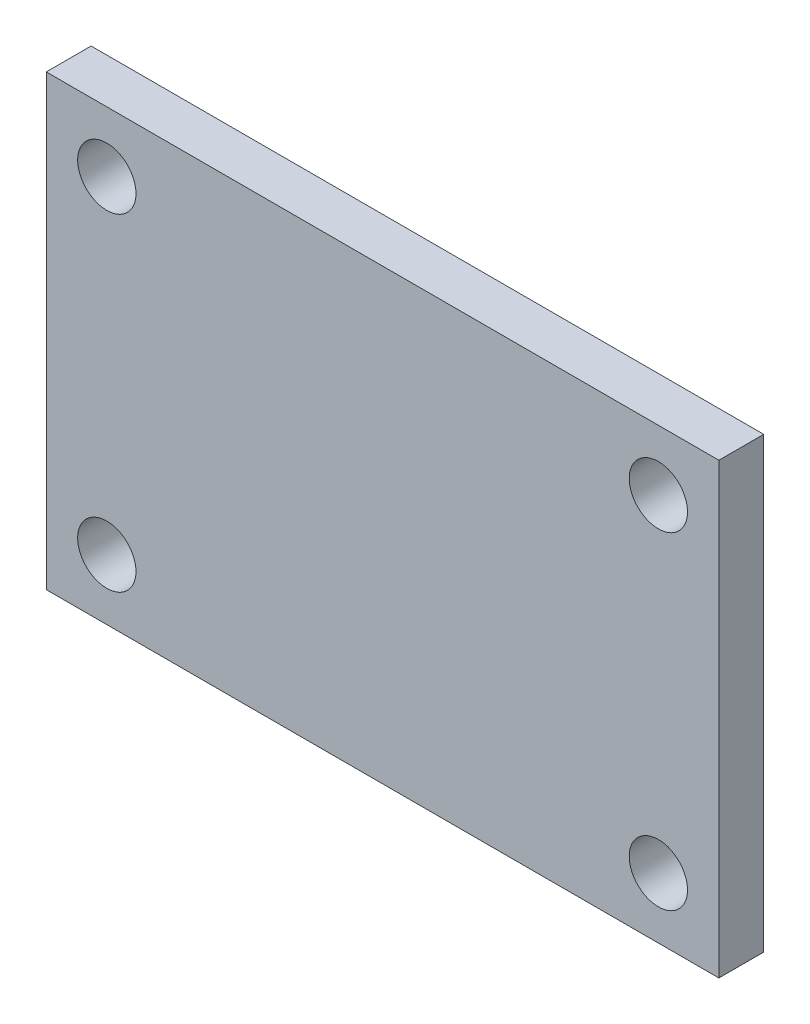
ISO-10303-21;
HEADER;
FILE_DESCRIPTION(('STEP AP214'),'2;1');
FILE_NAME('part.step','',(''),(''),'','','');
FILE_SCHEMA(('AUTOMOTIVE_DESIGN { 1 0 10303 214 1 1 1 1 }'));
ENDSEC;
DATA;
#1=APPLICATION_CONTEXT('core data for automotive mechanical design processes');
#2=APPLICATION_PROTOCOL_DEFINITION('international standard','automotive_design',2000,#1);
#3=PRODUCT_CONTEXT('',#1,'mechanical');
#4=PRODUCT('Part','Part','',(#3));
#5=PRODUCT_RELATED_PRODUCT_CATEGORY('part','',(#4));
#6=PRODUCT_DEFINITION_FORMATION('','',#4);
#7=PRODUCT_DEFINITION_CONTEXT('part definition',#1,'design');
#8=PRODUCT_DEFINITION('design','',#6,#7);
#9=PRODUCT_DEFINITION_SHAPE('','',#8);
#10=(LENGTH_UNIT() NAMED_UNIT(*) SI_UNIT(.MILLI.,.METRE.));
#11=(NAMED_UNIT(*) PLANE_ANGLE_UNIT() SI_UNIT($,.RADIAN.));
#12=(NAMED_UNIT(*) SI_UNIT($,.STERADIAN.) SOLID_ANGLE_UNIT());
#13=UNCERTAINTY_MEASURE_WITH_UNIT(LENGTH_MEASURE(1.E-05),#10,'distance_accuracy_value','');
#14=(GEOMETRIC_REPRESENTATION_CONTEXT(3) GLOBAL_UNCERTAINTY_ASSIGNED_CONTEXT((#13)) GLOBAL_UNIT_ASSIGNED_CONTEXT((#10,
#11,#12)) REPRESENTATION_CONTEXT('',''));
#15=CARTESIAN_POINT('',(0.,0.,0.));
#16=DIRECTION('',(0.,0.,1.));
#17=DIRECTION('',(1.,0.,0.));
#18=AXIS2_PLACEMENT_3D('',#15,#16,#17);
#19=CARTESIAN_POINT('',(150.,-50.,5.));
#20=DIRECTION('',(0.,1.,0.));
#21=DIRECTION('',(0.,0.,1.));
#22=AXIS2_PLACEMENT_3D('',#19,#20,#21);
#23=PLANE('',#22);
#24=DIRECTION('',(0.,0.,-1.));
#25=VECTOR('',#24,1.);
#26=CARTESIAN_POINT('',(0.,-50.,5.));
#27=LINE('',#26,#25);
#28=CARTESIAN_POINT('',(0.,-50.,5.));
#29=VERTEX_POINT('',#28);
#30=CARTESIAN_POINT('',(0.,-50.,-5.));
#31=VERTEX_POINT('',#30);
#32=EDGE_CURVE('E113',#29,#31,#27,.T.);
#33=ORIENTED_EDGE('',*,*,#32,.T.);
#34=DIRECTION('',(-1.,0.,0.));
#35=VECTOR('',#34,1.);
#36=CARTESIAN_POINT('',(150.,-50.,-5.));
#37=LINE('',#36,#35);
#38=CARTESIAN_POINT('',(150.,-50.,-5.));
#39=VERTEX_POINT('',#38);
#40=EDGE_CURVE('E12',#39,#31,#37,.T.);
#41=ORIENTED_EDGE('',*,*,#40,.F.);
#42=DIRECTION('',(0.,0.,-1.));
#43=VECTOR('',#42,1.);
#44=CARTESIAN_POINT('',(150.,-50.,5.));
#45=LINE('',#44,#43);
#46=CARTESIAN_POINT('',(150.,-50.,5.));
#47=VERTEX_POINT('',#46);
#48=EDGE_CURVE('E101',#47,#39,#45,.T.);
#49=ORIENTED_EDGE('',*,*,#48,.F.);
#50=DIRECTION('',(-1.,0.,0.));
#51=VECTOR('',#50,1.);
#52=CARTESIAN_POINT('',(150.,-50.,5.));
#53=LINE('',#52,#51);
#54=EDGE_CURVE('E109',#47,#29,#53,.T.);
#55=ORIENTED_EDGE('',*,*,#54,.T.);
#56=EDGE_LOOP('',(#33,#41,#49,#55));
#57=FACE_BOUND('',#56,.T.);
#58=ADVANCED_FACE('F50',(#57),#23,.F.);
#59=CARTESIAN_POINT('',(150.,-50.,-5.));
#60=DIRECTION('',(0.,0.,1.));
#61=DIRECTION('',(1.,0.,0.));
#62=AXIS2_PLACEMENT_3D('',#59,#60,#61);
#63=PLANE('',#62);
#64=CARTESIAN_POINT('',(13.5,36.5,-5.));
#65=DIRECTION('',(0.,0.,1.));
#66=DIRECTION('',(1.,0.,0.));
#67=AXIS2_PLACEMENT_3D('',#64,#65,#66);
#68=CIRCLE('',#67,6.5);
#69=CARTESIAN_POINT('',(20.,36.5,-5.));
#70=VERTEX_POINT('',#69);
#71=EDGE_CURVE('E144',#70,#70,#68,.T.);
#72=ORIENTED_EDGE('',*,*,#71,.T.);
#73=EDGE_LOOP('',(#72));
#74=FACE_BOUND('',#73,.T.);
#75=CARTESIAN_POINT('',(136.5,36.5,-5.));
#76=DIRECTION('',(0.,0.,1.));
#77=DIRECTION('',(1.,0.,0.));
#78=AXIS2_PLACEMENT_3D('',#75,#76,#77);
#79=CIRCLE('',#78,6.50000000000001);
#80=CARTESIAN_POINT('',(143.,36.5,-5.));
#81=VERTEX_POINT('',#80);
#82=EDGE_CURVE('E138',#81,#81,#79,.T.);
#83=ORIENTED_EDGE('',*,*,#82,.T.);
#84=EDGE_LOOP('',(#83));
#85=FACE_BOUND('',#84,.T.);
#86=CARTESIAN_POINT('',(136.5,-36.5,-5.));
#87=DIRECTION('',(0.,0.,1.));
#88=DIRECTION('',(1.,0.,0.));
#89=AXIS2_PLACEMENT_3D('',#86,#87,#88);
#90=CIRCLE('',#89,6.50000000000001);
#91=CARTESIAN_POINT('',(143.,-36.5,-5.));
#92=VERTEX_POINT('',#91);
#93=EDGE_CURVE('E132',#92,#92,#90,.T.);
#94=ORIENTED_EDGE('',*,*,#93,.T.);
#95=EDGE_LOOP('',(#94));
#96=FACE_BOUND('',#95,.T.);
#97=CARTESIAN_POINT('',(13.5,-36.5,-5.));
#98=DIRECTION('',(0.,0.,1.));
#99=DIRECTION('',(1.,0.,0.));
#100=AXIS2_PLACEMENT_3D('',#97,#98,#99);
#101=CIRCLE('',#100,6.5);
#102=CARTESIAN_POINT('',(20.,-36.5,-5.));
#103=VERTEX_POINT('',#102);
#104=EDGE_CURVE('E116',#103,#103,#101,.T.);
#105=ORIENTED_EDGE('',*,*,#104,.T.);
#106=EDGE_LOOP('',(#105));
#107=FACE_BOUND('',#106,.T.);
#108=DIRECTION('',(0.,1.,0.));
#109=VECTOR('',#108,1.);
#110=CARTESIAN_POINT('',(0.,-50.,-5.));
#111=LINE('',#110,#109);
#112=CARTESIAN_POINT('',(0.,50.,-5.));
#113=VERTEX_POINT('',#112);
#114=EDGE_CURVE('E105',#31,#113,#111,.T.);
#115=ORIENTED_EDGE('',*,*,#114,.T.);
#116=DIRECTION('',(-1.,0.,0.));
#117=VECTOR('',#116,1.);
#118=CARTESIAN_POINT('',(150.,50.,-5.));
#119=LINE('',#118,#117);
#120=CARTESIAN_POINT('',(150.,50.,-5.));
#121=VERTEX_POINT('',#120);
#122=EDGE_CURVE('E58',#121,#113,#119,.T.);
#123=ORIENTED_EDGE('',*,*,#122,.F.);
#124=DIRECTION('',(0.,1.,0.));
#125=VECTOR('',#124,1.);
#126=CARTESIAN_POINT('',(150.,-50.,-5.));
#127=LINE('',#126,#125);
#128=EDGE_CURVE('E96',#39,#121,#127,.T.);
#129=ORIENTED_EDGE('',*,*,#128,.F.);
#130=ORIENTED_EDGE('',*,*,#40,.T.);
#131=EDGE_LOOP('',(#115,#123,#129,#130));
#132=FACE_BOUND('',#131,.T.);
#133=ADVANCED_FACE('F104',(#74,#85,#96,#107,#132),#63,.F.);
#134=CARTESIAN_POINT('',(150.,50.,5.));
#135=DIRECTION('',(0.,-1.,0.));
#136=DIRECTION('',(0.,0.,-1.));
#137=AXIS2_PLACEMENT_3D('',#134,#135,#136);
#138=PLANE('',#137);
#139=DIRECTION('',(0.,0.,1.));
#140=VECTOR('',#139,1.);
#141=CARTESIAN_POINT('',(0.,50.,5.));
#142=LINE('',#141,#140);
#143=CARTESIAN_POINT('',(0.,50.,5.));
#144=VERTEX_POINT('',#143);
#145=EDGE_CURVE('E83',#113,#144,#142,.T.);
#146=ORIENTED_EDGE('',*,*,#145,.T.);
#147=DIRECTION('',(-1.,0.,0.));
#148=VECTOR('',#147,1.);
#149=CARTESIAN_POINT('',(150.,50.,5.));
#150=LINE('',#149,#148);
#151=CARTESIAN_POINT('',(150.,50.,5.));
#152=VERTEX_POINT('',#151);
#153=EDGE_CURVE('E106',#152,#144,#150,.T.);
#154=ORIENTED_EDGE('',*,*,#153,.F.);
#155=DIRECTION('',(0.,0.,1.));
#156=VECTOR('',#155,1.);
#157=CARTESIAN_POINT('',(150.,50.,5.));
#158=LINE('',#157,#156);
#159=EDGE_CURVE('E99',#121,#152,#158,.T.);
#160=ORIENTED_EDGE('',*,*,#159,.F.);
#161=ORIENTED_EDGE('',*,*,#122,.T.);
#162=EDGE_LOOP('',(#146,#154,#160,#161));
#163=FACE_BOUND('',#162,.T.);
#164=ADVANCED_FACE('F107',(#163),#138,.F.);
#165=CARTESIAN_POINT('',(150.,-50.,5.));
#166=DIRECTION('',(0.,0.,-1.));
#167=DIRECTION('',(-1.,0.,0.));
#168=AXIS2_PLACEMENT_3D('',#165,#166,#167);
#169=PLANE('',#168);
#170=CARTESIAN_POINT('',(13.5,36.5,5.));
#171=DIRECTION('',(0.,0.,1.));
#172=DIRECTION('',(1.,0.,0.));
#173=AXIS2_PLACEMENT_3D('',#170,#171,#172);
#174=CIRCLE('',#173,6.49999999999999);
#175=CARTESIAN_POINT('',(20.,36.5,5.));
#176=VERTEX_POINT('',#175);
#177=EDGE_CURVE('E147',#176,#176,#174,.T.);
#178=ORIENTED_EDGE('',*,*,#177,.F.);
#179=EDGE_LOOP('',(#178));
#180=FACE_BOUND('',#179,.T.);
#181=CARTESIAN_POINT('',(136.5,36.5,5.));
#182=DIRECTION('',(0.,0.,1.));
#183=DIRECTION('',(1.,0.,0.));
#184=AXIS2_PLACEMENT_3D('',#181,#182,#183);
#185=CIRCLE('',#184,6.49999999999998);
#186=CARTESIAN_POINT('',(143.,36.5,5.));
#187=VERTEX_POINT('',#186);
#188=EDGE_CURVE('E141',#187,#187,#185,.T.);
#189=ORIENTED_EDGE('',*,*,#188,.F.);
#190=EDGE_LOOP('',(#189));
#191=FACE_BOUND('',#190,.T.);
#192=CARTESIAN_POINT('',(136.5,-36.5,5.));
#193=DIRECTION('',(0.,0.,1.));
#194=DIRECTION('',(1.,0.,0.));
#195=AXIS2_PLACEMENT_3D('',#192,#193,#194);
#196=CIRCLE('',#195,6.49999999999998);
#197=CARTESIAN_POINT('',(143.,-36.5,5.));
#198=VERTEX_POINT('',#197);
#199=EDGE_CURVE('E135',#198,#198,#196,.T.);
#200=ORIENTED_EDGE('',*,*,#199,.F.);
#201=EDGE_LOOP('',(#200));
#202=FACE_BOUND('',#201,.T.);
#203=CARTESIAN_POINT('',(13.5,-36.5,5.));
#204=DIRECTION('',(0.,0.,1.));
#205=DIRECTION('',(1.,0.,0.));
#206=AXIS2_PLACEMENT_3D('',#203,#204,#205);
#207=CIRCLE('',#206,6.49999999999999);
#208=CARTESIAN_POINT('',(20.,-36.5,5.));
#209=VERTEX_POINT('',#208);
#210=EDGE_CURVE('E129',#209,#209,#207,.T.);
#211=ORIENTED_EDGE('',*,*,#210,.F.);
#212=EDGE_LOOP('',(#211));
#213=FACE_BOUND('',#212,.T.);
#214=DIRECTION('',(0.,-1.,0.));
#215=VECTOR('',#214,1.);
#216=CARTESIAN_POINT('',(0.,-50.,5.));
#217=LINE('',#216,#215);
#218=EDGE_CURVE('E89',#144,#29,#217,.T.);
#219=ORIENTED_EDGE('',*,*,#218,.T.);
#220=ORIENTED_EDGE('',*,*,#54,.F.);
#221=DIRECTION('',(0.,-1.,0.));
#222=VECTOR('',#221,1.);
#223=CARTESIAN_POINT('',(150.,-50.,5.));
#224=LINE('',#223,#222);
#225=EDGE_CURVE('E66',#152,#47,#224,.T.);
#226=ORIENTED_EDGE('',*,*,#225,.F.);
#227=ORIENTED_EDGE('',*,*,#153,.T.);
#228=EDGE_LOOP('',(#219,#220,#226,#227));
#229=FACE_BOUND('',#228,.T.);
#230=ADVANCED_FACE('F121',(#180,#191,#202,#213,#229),#169,.F.);
#231=CARTESIAN_POINT('',(150.,-50.,-5.));
#232=DIRECTION('',(1.,0.,0.));
#233=DIRECTION('',(0.,0.,-1.));
#234=AXIS2_PLACEMENT_3D('',#231,#232,#233);
#235=PLANE('',#234);
#236=ORIENTED_EDGE('',*,*,#48,.T.);
#237=ORIENTED_EDGE('',*,*,#128,.T.);
#238=ORIENTED_EDGE('',*,*,#159,.T.);
#239=ORIENTED_EDGE('',*,*,#225,.T.);
#240=EDGE_LOOP('',(#236,#237,#238,#239));
#241=FACE_BOUND('',#240,.T.);
#242=ADVANCED_FACE('F97',(#241),#235,.T.);
#243=CARTESIAN_POINT('',(0.,-50.,-5.));
#244=DIRECTION('',(1.,0.,0.));
#245=DIRECTION('',(0.,0.,-1.));
#246=AXIS2_PLACEMENT_3D('',#243,#244,#245);
#247=PLANE('',#246);
#248=ORIENTED_EDGE('',*,*,#32,.F.);
#249=ORIENTED_EDGE('',*,*,#218,.F.);
#250=ORIENTED_EDGE('',*,*,#145,.F.);
#251=ORIENTED_EDGE('',*,*,#114,.F.);
#252=EDGE_LOOP('',(#248,#249,#250,#251));
#253=FACE_BOUND('',#252,.T.);
#254=ADVANCED_FACE('F124',(#253),#247,.F.);
#255=CARTESIAN_POINT('',(13.5,-36.5,5.));
#256=DIRECTION('',(0.,0.,1.));
#257=DIRECTION('',(1.,0.,0.));
#258=AXIS2_PLACEMENT_3D('',#255,#256,#257);
#259=CYLINDRICAL_SURFACE('',#258,6.49999999999999);
#260=ORIENTED_EDGE('',*,*,#104,.F.);
#261=EDGE_LOOP('',(#260));
#262=FACE_BOUND('',#261,.T.);
#263=ORIENTED_EDGE('',*,*,#210,.T.);
#264=EDGE_LOOP('',(#263));
#265=FACE_BOUND('',#264,.T.);
#266=ADVANCED_FACE('F162',(#262,#265),#259,.F.);
#267=CARTESIAN_POINT('',(136.5,-36.5,5.));
#268=DIRECTION('',(0.,0.,1.));
#269=DIRECTION('',(1.,0.,0.));
#270=AXIS2_PLACEMENT_3D('',#267,#268,#269);
#271=CYLINDRICAL_SURFACE('',#270,6.49999999999999);
#272=ORIENTED_EDGE('',*,*,#93,.F.);
#273=EDGE_LOOP('',(#272));
#274=FACE_BOUND('',#273,.T.);
#275=ORIENTED_EDGE('',*,*,#199,.T.);
#276=EDGE_LOOP('',(#275));
#277=FACE_BOUND('',#276,.T.);
#278=ADVANCED_FACE('F164',(#274,#277),#271,.F.);
#279=CARTESIAN_POINT('',(136.5,36.5,5.));
#280=DIRECTION('',(0.,0.,1.));
#281=DIRECTION('',(1.,0.,0.));
#282=AXIS2_PLACEMENT_3D('',#279,#280,#281);
#283=CYLINDRICAL_SURFACE('',#282,6.49999999999999);
#284=ORIENTED_EDGE('',*,*,#82,.F.);
#285=EDGE_LOOP('',(#284));
#286=FACE_BOUND('',#285,.T.);
#287=ORIENTED_EDGE('',*,*,#188,.T.);
#288=EDGE_LOOP('',(#287));
#289=FACE_BOUND('',#288,.T.);
#290=ADVANCED_FACE('F171',(#286,#289),#283,.F.);
#291=CARTESIAN_POINT('',(13.5,36.5,5.));
#292=DIRECTION('',(0.,0.,1.));
#293=DIRECTION('',(1.,0.,0.));
#294=AXIS2_PLACEMENT_3D('',#291,#292,#293);
#295=CYLINDRICAL_SURFACE('',#294,6.49999999999999);
#296=ORIENTED_EDGE('',*,*,#71,.F.);
#297=EDGE_LOOP('',(#296));
#298=FACE_BOUND('',#297,.T.);
#299=ORIENTED_EDGE('',*,*,#177,.T.);
#300=EDGE_LOOP('',(#299));
#301=FACE_BOUND('',#300,.T.);
#302=ADVANCED_FACE('F151',(#298,#301),#295,.F.);
#303=CLOSED_SHELL('',(#58,#133,#164,#230,#242,#254,#266,#278,#290,#302));
#304=MANIFOLD_SOLID_BREP('B2',#303);
#305=ADVANCED_BREP_SHAPE_REPRESENTATION('',(#18,#304),#14);
#306=SHAPE_DEFINITION_REPRESENTATION(#9,#305);
ENDSEC;
END-ISO-10303-21;
